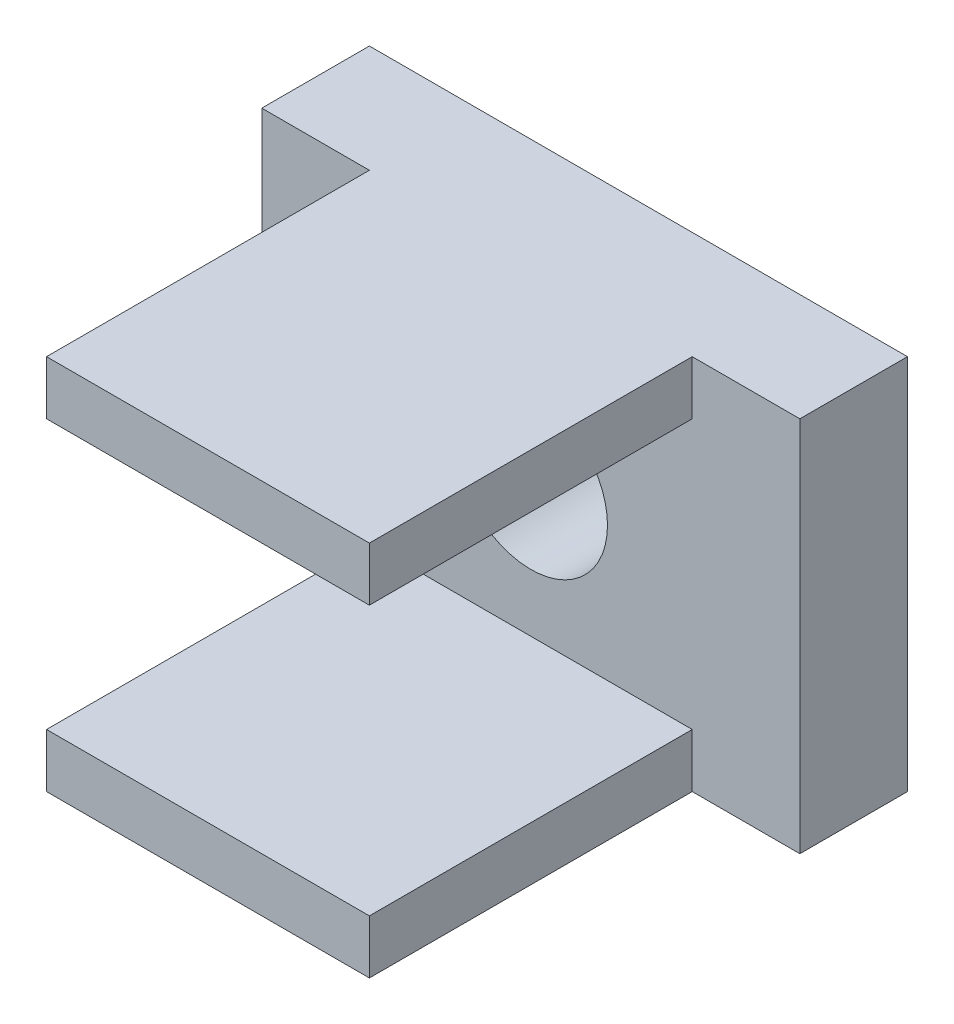
ISO-10303-21;
HEADER;
FILE_DESCRIPTION(('STEP AP214'),'2;1');
FILE_NAME('part.step','',(''),(''),'','','');
FILE_SCHEMA(('AUTOMOTIVE_DESIGN { 1 0 10303 214 1 1 1 1 }'));
ENDSEC;
DATA;
#1=APPLICATION_CONTEXT('core data for automotive mechanical design processes');
#2=APPLICATION_PROTOCOL_DEFINITION('international standard','automotive_design',2000,#1);
#3=PRODUCT_CONTEXT('',#1,'mechanical');
#4=PRODUCT('Part','Part','',(#3));
#5=PRODUCT_RELATED_PRODUCT_CATEGORY('part','',(#4));
#6=PRODUCT_DEFINITION_FORMATION('','',#4);
#7=PRODUCT_DEFINITION_CONTEXT('part definition',#1,'design');
#8=PRODUCT_DEFINITION('design','',#6,#7);
#9=PRODUCT_DEFINITION_SHAPE('','',#8);
#10=(LENGTH_UNIT() NAMED_UNIT(*) SI_UNIT(.MILLI.,.METRE.));
#11=(NAMED_UNIT(*) PLANE_ANGLE_UNIT() SI_UNIT($,.RADIAN.));
#12=(NAMED_UNIT(*) SI_UNIT($,.STERADIAN.) SOLID_ANGLE_UNIT());
#13=UNCERTAINTY_MEASURE_WITH_UNIT(LENGTH_MEASURE(1.E-05),#10,'distance_accuracy_value','');
#14=(GEOMETRIC_REPRESENTATION_CONTEXT(3) GLOBAL_UNCERTAINTY_ASSIGNED_CONTEXT((#13)) GLOBAL_UNIT_ASSIGNED_CONTEXT((#10,
#11,#12)) REPRESENTATION_CONTEXT('',''));
#15=CARTESIAN_POINT('',(0.,0.,0.));
#16=DIRECTION('',(0.,0.,1.));
#17=DIRECTION('',(1.,0.,0.));
#18=AXIS2_PLACEMENT_3D('',#15,#16,#17);
#19=CARTESIAN_POINT('',(0.,0.,2.));
#20=DIRECTION('',(0.,0.,-1.));
#21=DIRECTION('',(-1.,0.,0.));
#22=AXIS2_PLACEMENT_3D('',#19,#20,#21);
#23=PLANE('',#22);
#24=CARTESIAN_POINT('',(0.,0.,2.));
#25=DIRECTION('',(0.,0.,1.));
#26=DIRECTION('',(1.,0.,0.));
#27=AXIS2_PLACEMENT_3D('',#24,#25,#26);
#28=CIRCLE('',#27,1.425);
#29=CARTESIAN_POINT('',(1.425,0.,2.));
#30=VERTEX_POINT('',#29);
#31=EDGE_CURVE('E178',#30,#30,#28,.T.);
#32=ORIENTED_EDGE('',*,*,#31,.F.);
#33=EDGE_LOOP('',(#32));
#34=FACE_BOUND('',#33,.T.);
#35=DIRECTION('',(0.,-1.,0.));
#36=VECTOR('',#35,1.);
#37=CARTESIAN_POINT('',(-3.,-3.5,2.));
#38=LINE('',#37,#36);
#39=CARTESIAN_POINT('',(-3.,-2.5,2.));
#40=VERTEX_POINT('',#39);
#41=CARTESIAN_POINT('',(-3.,-3.5,2.));
#42=VERTEX_POINT('',#41);
#43=EDGE_CURVE('E48',#40,#42,#38,.T.);
#44=ORIENTED_EDGE('',*,*,#43,.F.);
#45=DIRECTION('',(-1.,0.,0.));
#46=VECTOR('',#45,1.);
#47=CARTESIAN_POINT('',(-3.,-2.5,2.));
#48=LINE('',#47,#46);
#49=CARTESIAN_POINT('',(3.,-2.5,2.));
#50=VERTEX_POINT('',#49);
#51=EDGE_CURVE('E52',#50,#40,#48,.T.);
#52=ORIENTED_EDGE('',*,*,#51,.F.);
#53=DIRECTION('',(0.,1.,0.));
#54=VECTOR('',#53,1.);
#55=CARTESIAN_POINT('',(3.,-3.5,2.));
#56=LINE('',#55,#54);
#57=CARTESIAN_POINT('',(3.,-3.5,2.));
#58=VERTEX_POINT('',#57);
#59=EDGE_CURVE('E226',#58,#50,#56,.T.);
#60=ORIENTED_EDGE('',*,*,#59,.F.);
#61=DIRECTION('',(1.,0.,0.));
#62=VECTOR('',#61,1.);
#63=CARTESIAN_POINT('',(-5.,-3.5,2.));
#64=LINE('',#63,#62);
#65=CARTESIAN_POINT('',(5.,-3.5,2.));
#66=VERTEX_POINT('',#65);
#67=EDGE_CURVE('E194',#58,#66,#64,.T.);
#68=ORIENTED_EDGE('',*,*,#67,.T.);
#69=DIRECTION('',(0.,1.,0.));
#70=VECTOR('',#69,1.);
#71=CARTESIAN_POINT('',(5.,-3.5,2.));
#72=LINE('',#71,#70);
#73=CARTESIAN_POINT('',(5.,3.5,2.));
#74=VERTEX_POINT('',#73);
#75=EDGE_CURVE('E185',#66,#74,#72,.T.);
#76=ORIENTED_EDGE('',*,*,#75,.T.);
#77=DIRECTION('',(-1.,0.,0.));
#78=VECTOR('',#77,1.);
#79=CARTESIAN_POINT('',(-5.,3.5,2.));
#80=LINE('',#79,#78);
#81=CARTESIAN_POINT('',(3.,3.5,2.));
#82=VERTEX_POINT('',#81);
#83=EDGE_CURVE('E190',#74,#82,#80,.T.);
#84=ORIENTED_EDGE('',*,*,#83,.T.);
#85=DIRECTION('',(0.,1.,0.));
#86=VECTOR('',#85,1.);
#87=CARTESIAN_POINT('',(3.,3.5,2.));
#88=LINE('',#87,#86);
#89=CARTESIAN_POINT('',(3.,2.5,2.));
#90=VERTEX_POINT('',#89);
#91=EDGE_CURVE('E143',#90,#82,#88,.T.);
#92=ORIENTED_EDGE('',*,*,#91,.F.);
#93=DIRECTION('',(1.,0.,0.));
#94=VECTOR('',#93,1.);
#95=CARTESIAN_POINT('',(-3.,2.5,2.));
#96=LINE('',#95,#94);
#97=CARTESIAN_POINT('',(-3.,2.5,2.));
#98=VERTEX_POINT('',#97);
#99=EDGE_CURVE('E156',#98,#90,#96,.T.);
#100=ORIENTED_EDGE('',*,*,#99,.F.);
#101=DIRECTION('',(0.,-1.,0.));
#102=VECTOR('',#101,1.);
#103=CARTESIAN_POINT('',(-3.,3.5,2.));
#104=LINE('',#103,#102);
#105=CARTESIAN_POINT('',(-3.,3.5,2.));
#106=VERTEX_POINT('',#105);
#107=EDGE_CURVE('E146',#106,#98,#104,.T.);
#108=ORIENTED_EDGE('',*,*,#107,.F.);
#109=CARTESIAN_POINT('',(-5.,3.5,2.));
#110=VERTEX_POINT('',#109);
#111=EDGE_CURVE('E188',#106,#110,#80,.T.);
#112=ORIENTED_EDGE('',*,*,#111,.T.);
#113=DIRECTION('',(0.,-1.,0.));
#114=VECTOR('',#113,1.);
#115=CARTESIAN_POINT('',(-5.,-3.5,2.));
#116=LINE('',#115,#114);
#117=CARTESIAN_POINT('',(-5.,-3.5,2.));
#118=VERTEX_POINT('',#117);
#119=EDGE_CURVE('E192',#110,#118,#116,.T.);
#120=ORIENTED_EDGE('',*,*,#119,.T.);
#121=EDGE_CURVE('E195',#118,#42,#64,.T.);
#122=ORIENTED_EDGE('',*,*,#121,.T.);
#123=EDGE_LOOP('',(#44,#52,#60,#68,#76,#84,#92,#100,#108,#112,#120,#122));
#124=FACE_BOUND('',#123,.T.);
#125=ADVANCED_FACE('F33',(#34,#124),#23,.F.);
#126=CARTESIAN_POINT('',(5.,-3.5,2.));
#127=DIRECTION('',(-1.,0.,0.));
#128=DIRECTION('',(0.,0.,1.));
#129=AXIS2_PLACEMENT_3D('',#126,#127,#128);
#130=PLANE('',#129);
#131=DIRECTION('',(0.,1.,0.));
#132=VECTOR('',#131,1.);
#133=CARTESIAN_POINT('',(5.,-3.5,0.));
#134=LINE('',#133,#132);
#135=CARTESIAN_POINT('',(5.,-3.5,0.));
#136=VERTEX_POINT('',#135);
#137=CARTESIAN_POINT('',(5.,3.5,0.));
#138=VERTEX_POINT('',#137);
#139=EDGE_CURVE('E182',#136,#138,#134,.T.);
#140=ORIENTED_EDGE('',*,*,#139,.T.);
#141=DIRECTION('',(0.,0.,-1.));
#142=VECTOR('',#141,1.);
#143=CARTESIAN_POINT('',(5.,3.5,2.));
#144=LINE('',#143,#142);
#145=EDGE_CURVE('E11',#74,#138,#144,.T.);
#146=ORIENTED_EDGE('',*,*,#145,.F.);
#147=ORIENTED_EDGE('',*,*,#75,.F.);
#148=DIRECTION('',(0.,0.,-1.));
#149=VECTOR('',#148,1.);
#150=CARTESIAN_POINT('',(5.,-3.5,2.));
#151=LINE('',#150,#149);
#152=EDGE_CURVE('E197',#66,#136,#151,.T.);
#153=ORIENTED_EDGE('',*,*,#152,.T.);
#154=EDGE_LOOP('',(#140,#146,#147,#153));
#155=FACE_BOUND('',#154,.T.);
#156=ADVANCED_FACE('F35',(#155),#130,.F.);
#157=CARTESIAN_POINT('',(-5.,3.5,2.));
#158=DIRECTION('',(0.,-1.,0.));
#159=DIRECTION('',(0.,0.,-1.));
#160=AXIS2_PLACEMENT_3D('',#157,#158,#159);
#161=PLANE('',#160);
#162=DIRECTION('',(-1.,0.,0.));
#163=VECTOR('',#162,1.);
#164=CARTESIAN_POINT('',(-5.,3.5,0.));
#165=LINE('',#164,#163);
#166=CARTESIAN_POINT('',(-5.,3.5,0.));
#167=VERTEX_POINT('',#166);
#168=EDGE_CURVE('E200',#138,#167,#165,.T.);
#169=ORIENTED_EDGE('',*,*,#168,.T.);
#170=DIRECTION('',(0.,0.,-1.));
#171=VECTOR('',#170,1.);
#172=CARTESIAN_POINT('',(-5.,3.5,2.));
#173=LINE('',#172,#171);
#174=EDGE_CURVE('E41',#110,#167,#173,.T.);
#175=ORIENTED_EDGE('',*,*,#174,.F.);
#176=ORIENTED_EDGE('',*,*,#111,.F.);
#177=DIRECTION('',(0.,0.,-1.));
#178=VECTOR('',#177,1.);
#179=CARTESIAN_POINT('',(-3.,3.5,8.));
#180=LINE('',#179,#178);
#181=CARTESIAN_POINT('',(-3.,3.5,8.));
#182=VERTEX_POINT('',#181);
#183=EDGE_CURVE('E172',#182,#106,#180,.T.);
#184=ORIENTED_EDGE('',*,*,#183,.F.);
#185=DIRECTION('',(-1.,0.,0.));
#186=VECTOR('',#185,1.);
#187=CARTESIAN_POINT('',(-3.,3.5,8.));
#188=LINE('',#187,#186);
#189=CARTESIAN_POINT('',(3.,3.5,8.));
#190=VERTEX_POINT('',#189);
#191=EDGE_CURVE('E155',#190,#182,#188,.T.);
#192=ORIENTED_EDGE('',*,*,#191,.F.);
#193=DIRECTION('',(0.,0.,-1.));
#194=VECTOR('',#193,1.);
#195=CARTESIAN_POINT('',(3.,3.5,8.));
#196=LINE('',#195,#194);
#197=EDGE_CURVE('E175',#190,#82,#196,.T.);
#198=ORIENTED_EDGE('',*,*,#197,.T.);
#199=ORIENTED_EDGE('',*,*,#83,.F.);
#200=ORIENTED_EDGE('',*,*,#145,.T.);
#201=EDGE_LOOP('',(#169,#175,#176,#184,#192,#198,#199,#200));
#202=FACE_BOUND('',#201,.T.);
#203=ADVANCED_FACE('F254',(#202),#161,.F.);
#204=CARTESIAN_POINT('',(-5.,-3.5,2.));
#205=DIRECTION('',(1.,0.,0.));
#206=DIRECTION('',(0.,0.,-1.));
#207=AXIS2_PLACEMENT_3D('',#204,#205,#206);
#208=PLANE('',#207);
#209=DIRECTION('',(0.,-1.,0.));
#210=VECTOR('',#209,1.);
#211=CARTESIAN_POINT('',(-5.,-3.5,0.));
#212=LINE('',#211,#210);
#213=CARTESIAN_POINT('',(-5.,-3.5,0.));
#214=VERTEX_POINT('',#213);
#215=EDGE_CURVE('E202',#167,#214,#212,.T.);
#216=ORIENTED_EDGE('',*,*,#215,.T.);
#217=DIRECTION('',(0.,0.,-1.));
#218=VECTOR('',#217,1.);
#219=CARTESIAN_POINT('',(-5.,-3.5,2.));
#220=LINE('',#219,#218);
#221=EDGE_CURVE('E207',#118,#214,#220,.T.);
#222=ORIENTED_EDGE('',*,*,#221,.F.);
#223=ORIENTED_EDGE('',*,*,#119,.F.);
#224=ORIENTED_EDGE('',*,*,#174,.T.);
#225=EDGE_LOOP('',(#216,#222,#223,#224));
#226=FACE_BOUND('',#225,.T.);
#227=ADVANCED_FACE('F214',(#226),#208,.F.);
#228=CARTESIAN_POINT('',(-5.,-3.5,2.));
#229=DIRECTION('',(0.,1.,0.));
#230=DIRECTION('',(0.,0.,1.));
#231=AXIS2_PLACEMENT_3D('',#228,#229,#230);
#232=PLANE('',#231);
#233=DIRECTION('',(1.,0.,0.));
#234=VECTOR('',#233,1.);
#235=CARTESIAN_POINT('',(-5.,-3.5,0.));
#236=LINE('',#235,#234);
#237=EDGE_CURVE('E189',#214,#136,#236,.T.);
#238=ORIENTED_EDGE('',*,*,#237,.T.);
#239=ORIENTED_EDGE('',*,*,#152,.F.);
#240=ORIENTED_EDGE('',*,*,#67,.F.);
#241=DIRECTION('',(0.,0.,-1.));
#242=VECTOR('',#241,1.);
#243=CARTESIAN_POINT('',(3.,-3.5,8.));
#244=LINE('',#243,#242);
#245=CARTESIAN_POINT('',(3.,-3.5,8.));
#246=VERTEX_POINT('',#245);
#247=EDGE_CURVE('E128',#246,#58,#244,.T.);
#248=ORIENTED_EDGE('',*,*,#247,.F.);
#249=DIRECTION('',(1.,0.,0.));
#250=VECTOR('',#249,1.);
#251=CARTESIAN_POINT('',(-3.,-3.5,8.));
#252=LINE('',#251,#250);
#253=CARTESIAN_POINT('',(-3.,-3.5,8.));
#254=VERTEX_POINT('',#253);
#255=EDGE_CURVE('E121',#254,#246,#252,.T.);
#256=ORIENTED_EDGE('',*,*,#255,.F.);
#257=DIRECTION('',(0.,0.,-1.));
#258=VECTOR('',#257,1.);
#259=CARTESIAN_POINT('',(-3.,-3.5,8.));
#260=LINE('',#259,#258);
#261=EDGE_CURVE('E126',#254,#42,#260,.T.);
#262=ORIENTED_EDGE('',*,*,#261,.T.);
#263=ORIENTED_EDGE('',*,*,#121,.F.);
#264=ORIENTED_EDGE('',*,*,#221,.T.);
#265=EDGE_LOOP('',(#238,#239,#240,#248,#256,#262,#263,#264));
#266=FACE_BOUND('',#265,.T.);
#267=ADVANCED_FACE('F123',(#266),#232,.F.);
#268=CARTESIAN_POINT('',(0.,0.,0.));
#269=DIRECTION('',(0.,0.,-1.));
#270=DIRECTION('',(-1.,0.,0.));
#271=AXIS2_PLACEMENT_3D('',#268,#269,#270);
#272=PLANE('',#271);
#273=CARTESIAN_POINT('',(0.,0.,0.));
#274=DIRECTION('',(0.,0.,1.));
#275=DIRECTION('',(1.,0.,0.));
#276=AXIS2_PLACEMENT_3D('',#273,#274,#275);
#277=CIRCLE('',#276,1.425);
#278=CARTESIAN_POINT('',(1.425,0.,0.));
#279=VERTEX_POINT('',#278);
#280=EDGE_CURVE('E179',#279,#279,#277,.T.);
#281=ORIENTED_EDGE('',*,*,#280,.T.);
#282=EDGE_LOOP('',(#281));
#283=FACE_BOUND('',#282,.T.);
#284=ORIENTED_EDGE('',*,*,#139,.F.);
#285=ORIENTED_EDGE('',*,*,#237,.F.);
#286=ORIENTED_EDGE('',*,*,#215,.F.);
#287=ORIENTED_EDGE('',*,*,#168,.F.);
#288=EDGE_LOOP('',(#284,#285,#286,#287));
#289=FACE_BOUND('',#288,.T.);
#290=ADVANCED_FACE('F221',(#283,#289),#272,.T.);
#291=CARTESIAN_POINT('',(0.,0.,0.));
#292=DIRECTION('',(0.,0.,1.));
#293=DIRECTION('',(1.,0.,0.));
#294=AXIS2_PLACEMENT_3D('',#291,#292,#293);
#295=CYLINDRICAL_SURFACE('',#294,1.425);
#296=ORIENTED_EDGE('',*,*,#280,.F.);
#297=EDGE_LOOP('',(#296));
#298=FACE_BOUND('',#297,.T.);
#299=ORIENTED_EDGE('',*,*,#31,.T.);
#300=EDGE_LOOP('',(#299));
#301=FACE_BOUND('',#300,.T.);
#302=ADVANCED_FACE('F258',(#298,#301),#295,.F.);
#303=CARTESIAN_POINT('',(3.,3.5,8.));
#304=DIRECTION('',(-1.,0.,0.));
#305=DIRECTION('',(0.,-1.,0.));
#306=AXIS2_PLACEMENT_3D('',#303,#304,#305);
#307=PLANE('',#306);
#308=ORIENTED_EDGE('',*,*,#91,.T.);
#309=ORIENTED_EDGE('',*,*,#197,.F.);
#310=DIRECTION('',(0.,1.,0.));
#311=VECTOR('',#310,1.);
#312=CARTESIAN_POINT('',(3.,3.5,8.));
#313=LINE('',#312,#311);
#314=CARTESIAN_POINT('',(3.,2.5,8.));
#315=VERTEX_POINT('',#314);
#316=EDGE_CURVE('E152',#315,#190,#313,.T.);
#317=ORIENTED_EDGE('',*,*,#316,.F.);
#318=DIRECTION('',(0.,0.,-1.));
#319=VECTOR('',#318,1.);
#320=CARTESIAN_POINT('',(3.,2.5,8.));
#321=LINE('',#320,#319);
#322=EDGE_CURVE('E161',#315,#90,#321,.T.);
#323=ORIENTED_EDGE('',*,*,#322,.T.);
#324=EDGE_LOOP('',(#308,#309,#317,#323));
#325=FACE_BOUND('',#324,.T.);
#326=ADVANCED_FACE('F273',(#325),#307,.F.);
#327=CARTESIAN_POINT('',(-3.,3.5,8.));
#328=DIRECTION('',(1.,0.,0.));
#329=DIRECTION('',(0.,1.,0.));
#330=AXIS2_PLACEMENT_3D('',#327,#328,#329);
#331=PLANE('',#330);
#332=ORIENTED_EDGE('',*,*,#107,.T.);
#333=DIRECTION('',(0.,0.,-1.));
#334=VECTOR('',#333,1.);
#335=CARTESIAN_POINT('',(-3.,2.5,8.));
#336=LINE('',#335,#334);
#337=CARTESIAN_POINT('',(-3.,2.5,8.));
#338=VERTEX_POINT('',#337);
#339=EDGE_CURVE('E169',#338,#98,#336,.T.);
#340=ORIENTED_EDGE('',*,*,#339,.F.);
#341=DIRECTION('',(0.,-1.,0.));
#342=VECTOR('',#341,1.);
#343=CARTESIAN_POINT('',(-3.,3.5,8.));
#344=LINE('',#343,#342);
#345=EDGE_CURVE('E158',#182,#338,#344,.T.);
#346=ORIENTED_EDGE('',*,*,#345,.F.);
#347=ORIENTED_EDGE('',*,*,#183,.T.);
#348=EDGE_LOOP('',(#332,#340,#346,#347));
#349=FACE_BOUND('',#348,.T.);
#350=ADVANCED_FACE('F281',(#349),#331,.F.);
#351=CARTESIAN_POINT('',(-3.,2.5,8.));
#352=DIRECTION('',(0.,1.,0.));
#353=DIRECTION('',(-1.,0.,0.));
#354=AXIS2_PLACEMENT_3D('',#351,#352,#353);
#355=PLANE('',#354);
#356=ORIENTED_EDGE('',*,*,#99,.T.);
#357=ORIENTED_EDGE('',*,*,#322,.F.);
#358=DIRECTION('',(1.,0.,0.));
#359=VECTOR('',#358,1.);
#360=CARTESIAN_POINT('',(-3.,2.5,8.));
#361=LINE('',#360,#359);
#362=EDGE_CURVE('E160',#338,#315,#361,.T.);
#363=ORIENTED_EDGE('',*,*,#362,.F.);
#364=ORIENTED_EDGE('',*,*,#339,.T.);
#365=EDGE_LOOP('',(#356,#357,#363,#364));
#366=FACE_BOUND('',#365,.T.);
#367=ADVANCED_FACE('F276',(#366),#355,.F.);
#368=CARTESIAN_POINT('',(0.,0.,8.));
#369=DIRECTION('',(0.,0.,1.));
#370=DIRECTION('',(1.,0.,0.));
#371=AXIS2_PLACEMENT_3D('',#368,#369,#370);
#372=PLANE('',#371);
#373=ORIENTED_EDGE('',*,*,#316,.T.);
#374=ORIENTED_EDGE('',*,*,#191,.T.);
#375=ORIENTED_EDGE('',*,*,#345,.T.);
#376=ORIENTED_EDGE('',*,*,#362,.T.);
#377=EDGE_LOOP('',(#373,#374,#375,#376));
#378=FACE_BOUND('',#377,.T.);
#379=ADVANCED_FACE('F283',(#378),#372,.T.);
#380=CARTESIAN_POINT('',(-3.,-3.5,8.));
#381=DIRECTION('',(1.,0.,0.));
#382=DIRECTION('',(0.,1.,0.));
#383=AXIS2_PLACEMENT_3D('',#380,#381,#382);
#384=PLANE('',#383);
#385=ORIENTED_EDGE('',*,*,#43,.T.);
#386=ORIENTED_EDGE('',*,*,#261,.F.);
#387=DIRECTION('',(0.,-1.,0.));
#388=VECTOR('',#387,1.);
#389=CARTESIAN_POINT('',(-3.,-3.5,8.));
#390=LINE('',#389,#388);
#391=CARTESIAN_POINT('',(-3.,-2.5,8.));
#392=VERTEX_POINT('',#391);
#393=EDGE_CURVE('E132',#392,#254,#390,.T.);
#394=ORIENTED_EDGE('',*,*,#393,.F.);
#395=DIRECTION('',(0.,0.,-1.));
#396=VECTOR('',#395,1.);
#397=CARTESIAN_POINT('',(-3.,-2.5,8.));
#398=LINE('',#397,#396);
#399=EDGE_CURVE('E233',#392,#40,#398,.T.);
#400=ORIENTED_EDGE('',*,*,#399,.T.);
#401=EDGE_LOOP('',(#385,#386,#394,#400));
#402=FACE_BOUND('',#401,.T.);
#403=ADVANCED_FACE('F142',(#402),#384,.F.);
#404=CARTESIAN_POINT('',(3.,-3.5,8.));
#405=DIRECTION('',(-1.,0.,0.));
#406=DIRECTION('',(0.,-1.,0.));
#407=AXIS2_PLACEMENT_3D('',#404,#405,#406);
#408=PLANE('',#407);
#409=ORIENTED_EDGE('',*,*,#59,.T.);
#410=DIRECTION('',(0.,0.,-1.));
#411=VECTOR('',#410,1.);
#412=CARTESIAN_POINT('',(3.,-2.5,8.));
#413=LINE('',#412,#411);
#414=CARTESIAN_POINT('',(3.,-2.5,8.));
#415=VERTEX_POINT('',#414);
#416=EDGE_CURVE('E148',#415,#50,#413,.T.);
#417=ORIENTED_EDGE('',*,*,#416,.F.);
#418=DIRECTION('',(0.,1.,0.));
#419=VECTOR('',#418,1.);
#420=CARTESIAN_POINT('',(3.,-3.5,8.));
#421=LINE('',#420,#419);
#422=EDGE_CURVE('E131',#246,#415,#421,.T.);
#423=ORIENTED_EDGE('',*,*,#422,.F.);
#424=ORIENTED_EDGE('',*,*,#247,.T.);
#425=EDGE_LOOP('',(#409,#417,#423,#424));
#426=FACE_BOUND('',#425,.T.);
#427=ADVANCED_FACE('F231',(#426),#408,.F.);
#428=CARTESIAN_POINT('',(-3.,-2.5,8.));
#429=DIRECTION('',(0.,-1.,0.));
#430=DIRECTION('',(1.,0.,0.));
#431=AXIS2_PLACEMENT_3D('',#428,#429,#430);
#432=PLANE('',#431);
#433=ORIENTED_EDGE('',*,*,#51,.T.);
#434=ORIENTED_EDGE('',*,*,#399,.F.);
#435=DIRECTION('',(-1.,0.,0.));
#436=VECTOR('',#435,1.);
#437=CARTESIAN_POINT('',(-3.,-2.5,8.));
#438=LINE('',#437,#436);
#439=EDGE_CURVE('E137',#415,#392,#438,.T.);
#440=ORIENTED_EDGE('',*,*,#439,.F.);
#441=ORIENTED_EDGE('',*,*,#416,.T.);
#442=EDGE_LOOP('',(#433,#434,#440,#441));
#443=FACE_BOUND('',#442,.T.);
#444=ADVANCED_FACE('F239',(#443),#432,.F.);
#445=CARTESIAN_POINT('',(0.,0.,8.));
#446=DIRECTION('',(0.,0.,-1.));
#447=DIRECTION('',(-1.,0.,0.));
#448=AXIS2_PLACEMENT_3D('',#445,#446,#447);
#449=PLANE('',#448);
#450=ORIENTED_EDGE('',*,*,#393,.T.);
#451=ORIENTED_EDGE('',*,*,#255,.T.);
#452=ORIENTED_EDGE('',*,*,#422,.T.);
#453=ORIENTED_EDGE('',*,*,#439,.T.);
#454=EDGE_LOOP('',(#450,#451,#452,#453));
#455=FACE_BOUND('',#454,.T.);
#456=ADVANCED_FACE('F135',(#455),#449,.F.);
#457=CLOSED_SHELL('',(#125,#156,#203,#227,#267,#290,#302,#326,#350,#367,#379,#403,#427,#444,#456));
#458=MANIFOLD_SOLID_BREP('B2',#457);
#459=ADVANCED_BREP_SHAPE_REPRESENTATION('',(#18,#458),#14);
#460=SHAPE_DEFINITION_REPRESENTATION(#9,#459);
ENDSEC;
END-ISO-10303-21;
